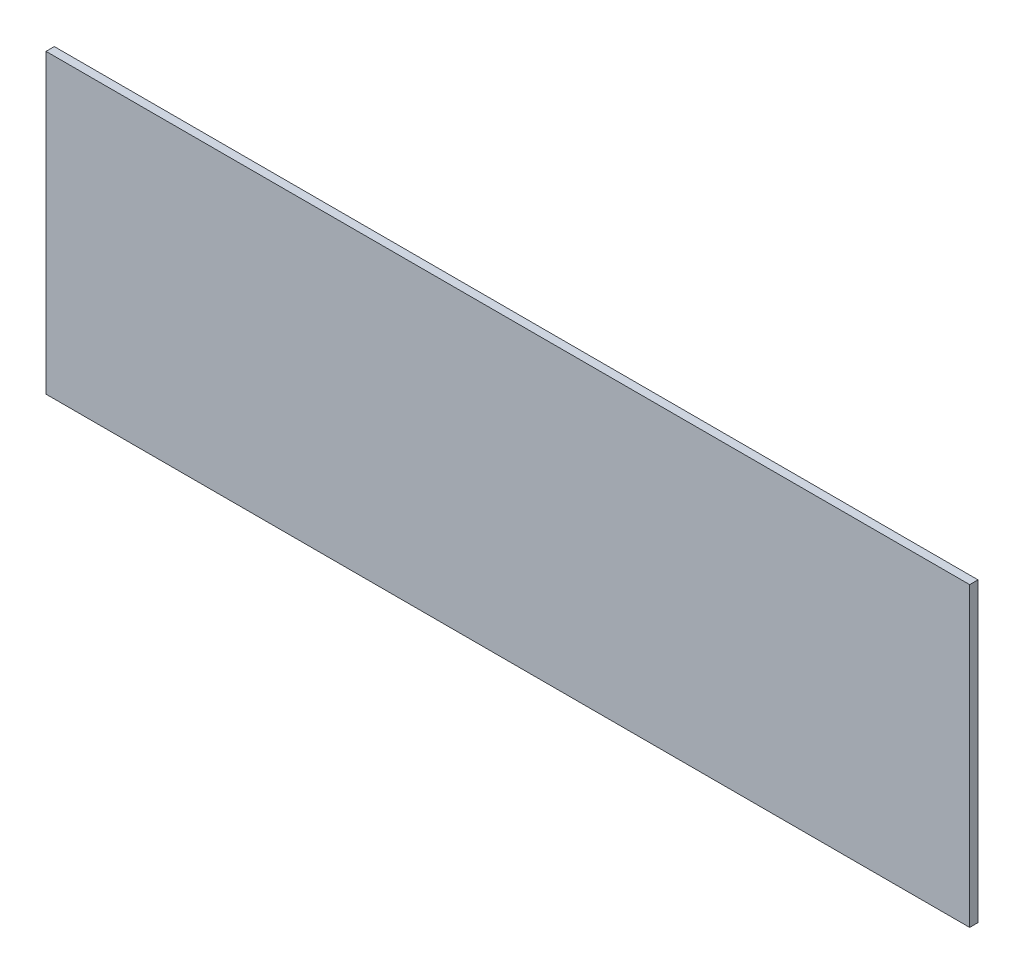
ISO-10303-21;
HEADER;
FILE_DESCRIPTION(('STEP AP214'),'2;1');
FILE_NAME('part.step','',(''),(''),'','','');
FILE_SCHEMA(('AUTOMOTIVE_DESIGN { 1 0 10303 214 1 1 1 1 }'));
ENDSEC;
DATA;
#1=APPLICATION_CONTEXT('core data for automotive mechanical design processes');
#2=APPLICATION_PROTOCOL_DEFINITION('international standard','automotive_design',2000,#1);
#3=PRODUCT_CONTEXT('',#1,'mechanical');
#4=PRODUCT('Part','Part','',(#3));
#5=PRODUCT_RELATED_PRODUCT_CATEGORY('part','',(#4));
#6=PRODUCT_DEFINITION_FORMATION('','',#4);
#7=PRODUCT_DEFINITION_CONTEXT('part definition',#1,'design');
#8=PRODUCT_DEFINITION('design','',#6,#7);
#9=PRODUCT_DEFINITION_SHAPE('','',#8);
#10=(LENGTH_UNIT() NAMED_UNIT(*) SI_UNIT(.MILLI.,.METRE.));
#11=(NAMED_UNIT(*) PLANE_ANGLE_UNIT() SI_UNIT($,.RADIAN.));
#12=(NAMED_UNIT(*) SI_UNIT($,.STERADIAN.) SOLID_ANGLE_UNIT());
#13=UNCERTAINTY_MEASURE_WITH_UNIT(LENGTH_MEASURE(1.E-05),#10,'distance_accuracy_value','');
#14=(GEOMETRIC_REPRESENTATION_CONTEXT(3) GLOBAL_UNCERTAINTY_ASSIGNED_CONTEXT((#13)) GLOBAL_UNIT_ASSIGNED_CONTEXT((#10,
#11,#12)) REPRESENTATION_CONTEXT('',''));
#15=CARTESIAN_POINT('',(0.,0.,0.));
#16=DIRECTION('',(0.,0.,1.));
#17=DIRECTION('',(1.,0.,0.));
#18=AXIS2_PLACEMENT_3D('',#15,#16,#17);
#19=CARTESIAN_POINT('',(0.,0.,1.6));
#20=DIRECTION('',(1.,0.,0.));
#21=DIRECTION('',(0.,1.,0.));
#22=AXIS2_PLACEMENT_3D('',#19,#20,#21);
#23=PLANE('',#22);
#24=DIRECTION('',(0.,-1.,0.));
#25=VECTOR('',#24,1.);
#26=CARTESIAN_POINT('',(0.,0.,0.));
#27=LINE('',#26,#25);
#28=CARTESIAN_POINT('',(0.,0.,0.));
#29=VERTEX_POINT('',#28);
#30=CARTESIAN_POINT('',(0.,-57.15,0.));
#31=VERTEX_POINT('',#30);
#32=EDGE_CURVE('E96',#29,#31,#27,.T.);
#33=ORIENTED_EDGE('',*,*,#32,.T.);
#34=DIRECTION('',(0.,0.,-1.));
#35=VECTOR('',#34,1.);
#36=CARTESIAN_POINT('',(0.,-57.15,1.6));
#37=LINE('',#36,#35);
#38=CARTESIAN_POINT('',(0.,-57.15,1.6));
#39=VERTEX_POINT('',#38);
#40=EDGE_CURVE('E11',#39,#31,#37,.T.);
#41=ORIENTED_EDGE('',*,*,#40,.F.);
#42=DIRECTION('',(0.,-1.,0.));
#43=VECTOR('',#42,1.);
#44=CARTESIAN_POINT('',(0.,0.,1.6));
#45=LINE('',#44,#43);
#46=CARTESIAN_POINT('',(0.,0.,1.6));
#47=VERTEX_POINT('',#46);
#48=EDGE_CURVE('E84',#47,#39,#45,.T.);
#49=ORIENTED_EDGE('',*,*,#48,.F.);
#50=DIRECTION('',(0.,0.,-1.));
#51=VECTOR('',#50,1.);
#52=CARTESIAN_POINT('',(0.,0.,1.6));
#53=LINE('',#52,#51);
#54=EDGE_CURVE('E92',#47,#29,#53,.T.);
#55=ORIENTED_EDGE('',*,*,#54,.T.);
#56=EDGE_LOOP('',(#33,#41,#49,#55));
#57=FACE_BOUND('',#56,.T.);
#58=ADVANCED_FACE('F33',(#57),#23,.F.);
#59=CARTESIAN_POINT('',(0.,-57.15,1.6));
#60=DIRECTION('',(0.,1.,0.));
#61=DIRECTION('',(0.,0.,1.));
#62=AXIS2_PLACEMENT_3D('',#59,#60,#61);
#63=PLANE('',#62);
#64=DIRECTION('',(1.,0.,0.));
#65=VECTOR('',#64,1.);
#66=CARTESIAN_POINT('',(0.,-57.15,0.));
#67=LINE('',#66,#65);
#68=CARTESIAN_POINT('',(177.8,-57.15,0.));
#69=VERTEX_POINT('',#68);
#70=EDGE_CURVE('E88',#31,#69,#67,.T.);
#71=ORIENTED_EDGE('',*,*,#70,.T.);
#72=DIRECTION('',(0.,0.,-1.));
#73=VECTOR('',#72,1.);
#74=CARTESIAN_POINT('',(177.8,-57.15,1.6));
#75=LINE('',#74,#73);
#76=CARTESIAN_POINT('',(177.8,-57.15,1.6));
#77=VERTEX_POINT('',#76);
#78=EDGE_CURVE('E41',#77,#69,#75,.T.);
#79=ORIENTED_EDGE('',*,*,#78,.F.);
#80=DIRECTION('',(1.,0.,0.));
#81=VECTOR('',#80,1.);
#82=CARTESIAN_POINT('',(0.,-57.15,1.6));
#83=LINE('',#82,#81);
#84=EDGE_CURVE('E79',#39,#77,#83,.T.);
#85=ORIENTED_EDGE('',*,*,#84,.F.);
#86=ORIENTED_EDGE('',*,*,#40,.T.);
#87=EDGE_LOOP('',(#71,#79,#85,#86));
#88=FACE_BOUND('',#87,.T.);
#89=ADVANCED_FACE('F87',(#88),#63,.F.);
#90=CARTESIAN_POINT('',(177.8,0.,1.6));
#91=DIRECTION('',(-1.,0.,0.));
#92=DIRECTION('',(0.,0.,1.));
#93=AXIS2_PLACEMENT_3D('',#90,#91,#92);
#94=PLANE('',#93);
#95=DIRECTION('',(0.,1.,0.));
#96=VECTOR('',#95,1.);
#97=CARTESIAN_POINT('',(177.8,0.,0.));
#98=LINE('',#97,#96);
#99=CARTESIAN_POINT('',(177.8,0.,0.));
#100=VERTEX_POINT('',#99);
#101=EDGE_CURVE('E66',#69,#100,#98,.T.);
#102=ORIENTED_EDGE('',*,*,#101,.T.);
#103=DIRECTION('',(0.,0.,-1.));
#104=VECTOR('',#103,1.);
#105=CARTESIAN_POINT('',(177.8,0.,1.6));
#106=LINE('',#105,#104);
#107=CARTESIAN_POINT('',(177.8,0.,1.6));
#108=VERTEX_POINT('',#107);
#109=EDGE_CURVE('E89',#108,#100,#106,.T.);
#110=ORIENTED_EDGE('',*,*,#109,.F.);
#111=DIRECTION('',(0.,1.,0.));
#112=VECTOR('',#111,1.);
#113=CARTESIAN_POINT('',(177.8,0.,1.6));
#114=LINE('',#113,#112);
#115=EDGE_CURVE('E82',#77,#108,#114,.T.);
#116=ORIENTED_EDGE('',*,*,#115,.F.);
#117=ORIENTED_EDGE('',*,*,#78,.T.);
#118=EDGE_LOOP('',(#102,#110,#116,#117));
#119=FACE_BOUND('',#118,.T.);
#120=ADVANCED_FACE('F90',(#119),#94,.F.);
#121=CARTESIAN_POINT('',(0.,0.,1.6));
#122=DIRECTION('',(0.,-1.,0.));
#123=DIRECTION('',(0.,0.,-1.));
#124=AXIS2_PLACEMENT_3D('',#121,#122,#123);
#125=PLANE('',#124);
#126=DIRECTION('',(-1.,0.,0.));
#127=VECTOR('',#126,1.);
#128=CARTESIAN_POINT('',(0.,0.,0.));
#129=LINE('',#128,#127);
#130=EDGE_CURVE('E72',#100,#29,#129,.T.);
#131=ORIENTED_EDGE('',*,*,#130,.T.);
#132=ORIENTED_EDGE('',*,*,#54,.F.);
#133=DIRECTION('',(-1.,0.,0.));
#134=VECTOR('',#133,1.);
#135=CARTESIAN_POINT('',(0.,0.,1.6));
#136=LINE('',#135,#134);
#137=EDGE_CURVE('E49',#108,#47,#136,.T.);
#138=ORIENTED_EDGE('',*,*,#137,.F.);
#139=ORIENTED_EDGE('',*,*,#109,.T.);
#140=EDGE_LOOP('',(#131,#132,#138,#139));
#141=FACE_BOUND('',#140,.T.);
#142=ADVANCED_FACE('F103',(#141),#125,.F.);
#143=CARTESIAN_POINT('',(0.,0.,1.6));
#144=DIRECTION('',(0.,0.,1.));
#145=DIRECTION('',(1.,0.,0.));
#146=AXIS2_PLACEMENT_3D('',#143,#144,#145);
#147=PLANE('',#146);
#148=ORIENTED_EDGE('',*,*,#48,.T.);
#149=ORIENTED_EDGE('',*,*,#84,.T.);
#150=ORIENTED_EDGE('',*,*,#115,.T.);
#151=ORIENTED_EDGE('',*,*,#137,.T.);
#152=EDGE_LOOP('',(#148,#149,#150,#151));
#153=FACE_BOUND('',#152,.T.);
#154=ADVANCED_FACE('F80',(#153),#147,.T.);
#155=CARTESIAN_POINT('',(0.,0.,0.));
#156=DIRECTION('',(0.,0.,1.));
#157=DIRECTION('',(1.,0.,0.));
#158=AXIS2_PLACEMENT_3D('',#155,#156,#157);
#159=PLANE('',#158);
#160=ORIENTED_EDGE('',*,*,#32,.F.);
#161=ORIENTED_EDGE('',*,*,#130,.F.);
#162=ORIENTED_EDGE('',*,*,#101,.F.);
#163=ORIENTED_EDGE('',*,*,#70,.F.);
#164=EDGE_LOOP('',(#160,#161,#162,#163));
#165=FACE_BOUND('',#164,.T.);
#166=ADVANCED_FACE('F106',(#165),#159,.F.);
#167=CLOSED_SHELL('',(#58,#89,#120,#142,#154,#166));
#168=MANIFOLD_SOLID_BREP('B2',#167);
#169=ADVANCED_BREP_SHAPE_REPRESENTATION('',(#18,#168),#14);
#170=SHAPE_DEFINITION_REPRESENTATION(#9,#169);
ENDSEC;
END-ISO-10303-21;
